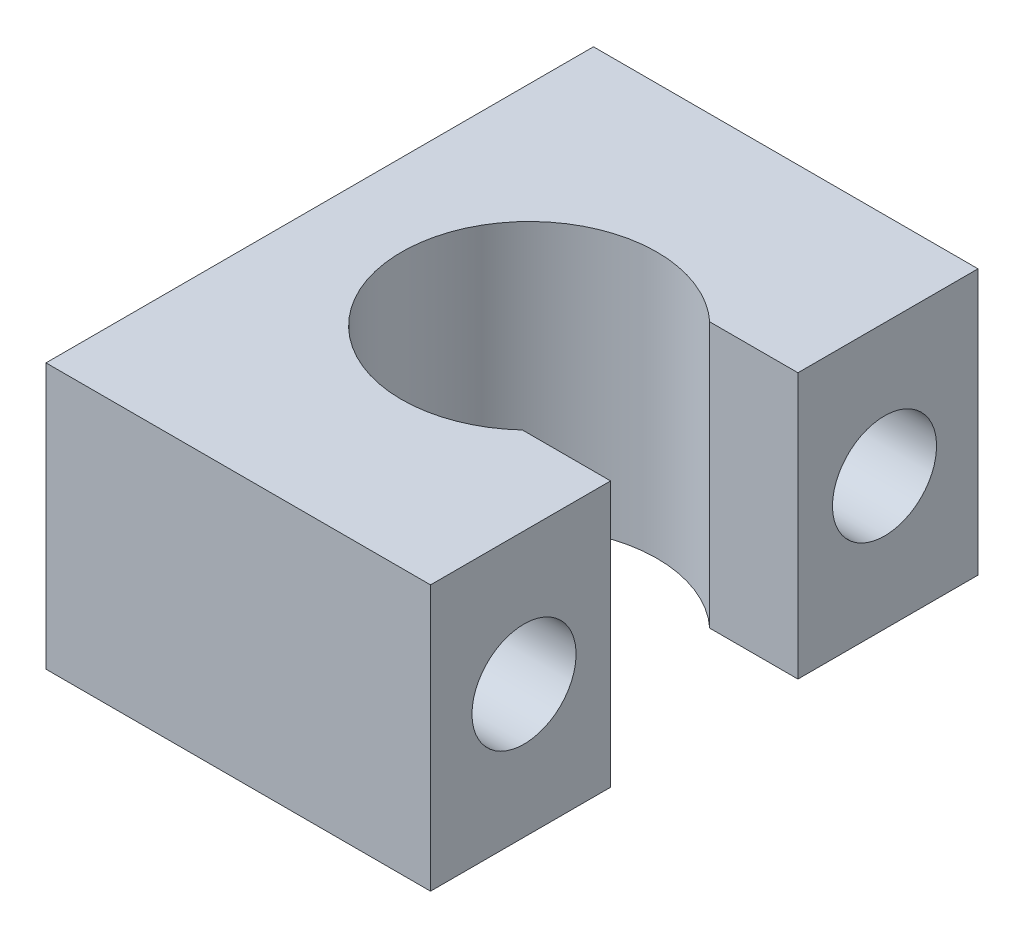
ISO-10303-21;
HEADER;
FILE_DESCRIPTION(('STEP AP214'),'2;1');
FILE_NAME('part.step','',(''),(''),'','','');
FILE_SCHEMA(('AUTOMOTIVE_DESIGN { 1 0 10303 214 1 1 1 1 }'));
ENDSEC;
DATA;
#1=APPLICATION_CONTEXT('core data for automotive mechanical design processes');
#2=APPLICATION_PROTOCOL_DEFINITION('international standard','automotive_design',2000,#1);
#3=PRODUCT_CONTEXT('',#1,'mechanical');
#4=PRODUCT('Part','Part','',(#3));
#5=PRODUCT_RELATED_PRODUCT_CATEGORY('part','',(#4));
#6=PRODUCT_DEFINITION_FORMATION('','',#4);
#7=PRODUCT_DEFINITION_CONTEXT('part definition',#1,'design');
#8=PRODUCT_DEFINITION('design','',#6,#7);
#9=PRODUCT_DEFINITION_SHAPE('','',#8);
#10=(LENGTH_UNIT() NAMED_UNIT(*) SI_UNIT(.MILLI.,.METRE.));
#11=(NAMED_UNIT(*) PLANE_ANGLE_UNIT() SI_UNIT($,.RADIAN.));
#12=(NAMED_UNIT(*) SI_UNIT($,.STERADIAN.) SOLID_ANGLE_UNIT());
#13=UNCERTAINTY_MEASURE_WITH_UNIT(LENGTH_MEASURE(1.E-05),#10,'distance_accuracy_value','');
#14=(GEOMETRIC_REPRESENTATION_CONTEXT(3) GLOBAL_UNCERTAINTY_ASSIGNED_CONTEXT((#13)) GLOBAL_UNIT_ASSIGNED_CONTEXT((#10,
#11,#12)) REPRESENTATION_CONTEXT('',''));
#15=CARTESIAN_POINT('',(0.,0.,0.));
#16=DIRECTION('',(0.,0.,1.));
#17=DIRECTION('',(1.,0.,0.));
#18=AXIS2_PLACEMENT_3D('',#15,#16,#17);
#19=CARTESIAN_POINT('',(10.16,14.02,14.465));
#20=DIRECTION('',(-1.,0.,0.));
#21=DIRECTION('',(0.,0.,1.));
#22=AXIS2_PLACEMENT_3D('',#19,#20,#21);
#23=PLANE('',#22);
#24=CARTESIAN_POINT('',(10.16,7.01,9.525));
#25=DIRECTION('',(-1.,0.,0.));
#26=DIRECTION('',(0.,0.,1.));
#27=AXIS2_PLACEMENT_3D('',#24,#25,#26);
#28=CIRCLE('',#27,2.75);
#29=CARTESIAN_POINT('',(10.16,7.01,12.275));
#30=VERTEX_POINT('',#29);
#31=EDGE_CURVE('E162',#30,#30,#28,.T.);
#32=ORIENTED_EDGE('',*,*,#31,.T.);
#33=EDGE_LOOP('',(#32));
#34=FACE_BOUND('',#33,.T.);
#35=DIRECTION('',(0.,0.,-1.));
#36=VECTOR('',#35,1.);
#37=CARTESIAN_POINT('',(10.16,0.,14.465));
#38=LINE('',#37,#36);
#39=CARTESIAN_POINT('',(10.16,0.,14.465));
#40=VERTEX_POINT('',#39);
#41=CARTESIAN_POINT('',(10.16,0.,4.95));
#42=VERTEX_POINT('',#41);
#43=EDGE_CURVE('E133',#40,#42,#38,.T.);
#44=ORIENTED_EDGE('',*,*,#43,.T.);
#45=DIRECTION('',(0.,1.,0.));
#46=VECTOR('',#45,1.);
#47=CARTESIAN_POINT('',(10.16,0.,4.95));
#48=LINE('',#47,#46);
#49=CARTESIAN_POINT('',(10.16,14.02,4.95));
#50=VERTEX_POINT('',#49);
#51=EDGE_CURVE('E166',#42,#50,#48,.T.);
#52=ORIENTED_EDGE('',*,*,#51,.T.);
#53=DIRECTION('',(0.,0.,-1.));
#54=VECTOR('',#53,1.);
#55=CARTESIAN_POINT('',(10.16,14.02,14.465));
#56=LINE('',#55,#54);
#57=CARTESIAN_POINT('',(10.16,14.02,14.465));
#58=VERTEX_POINT('',#57);
#59=EDGE_CURVE('E152',#58,#50,#56,.T.);
#60=ORIENTED_EDGE('',*,*,#59,.F.);
#61=DIRECTION('',(0.,-1.,0.));
#62=VECTOR('',#61,1.);
#63=CARTESIAN_POINT('',(10.16,14.02,14.465));
#64=LINE('',#63,#62);
#65=EDGE_CURVE('E47',#58,#40,#64,.T.);
#66=ORIENTED_EDGE('',*,*,#65,.T.);
#67=EDGE_LOOP('',(#44,#52,#60,#66));
#68=FACE_BOUND('',#67,.T.);
#69=ADVANCED_FACE('F39',(#34,#68),#23,.F.);
#70=CARTESIAN_POINT('',(-10.16,14.02,14.465));
#71=DIRECTION('',(1.,0.,0.));
#72=DIRECTION('',(0.,0.,-1.));
#73=AXIS2_PLACEMENT_3D('',#70,#71,#72);
#74=PLANE('',#73);
#75=CARTESIAN_POINT('',(-10.16,7.01,9.525));
#76=DIRECTION('',(-1.,0.,0.));
#77=DIRECTION('',(0.,0.,1.));
#78=AXIS2_PLACEMENT_3D('',#75,#76,#77);
#79=CIRCLE('',#78,2.75);
#80=CARTESIAN_POINT('',(-10.16,7.01,12.275));
#81=VERTEX_POINT('',#80);
#82=EDGE_CURVE('E286',#81,#81,#79,.T.);
#83=ORIENTED_EDGE('',*,*,#82,.F.);
#84=EDGE_LOOP('',(#83));
#85=FACE_BOUND('',#84,.T.);
#86=CARTESIAN_POINT('',(-10.16,7.01,-9.525));
#87=DIRECTION('',(-1.,0.,0.));
#88=DIRECTION('',(0.,0.,1.));
#89=AXIS2_PLACEMENT_3D('',#86,#87,#88);
#90=CIRCLE('',#89,2.75);
#91=CARTESIAN_POINT('',(-10.16,7.01,-6.775));
#92=VERTEX_POINT('',#91);
#93=EDGE_CURVE('E291',#92,#92,#90,.T.);
#94=ORIENTED_EDGE('',*,*,#93,.F.);
#95=EDGE_LOOP('',(#94));
#96=FACE_BOUND('',#95,.T.);
#97=DIRECTION('',(0.,0.,1.));
#98=VECTOR('',#97,1.);
#99=CARTESIAN_POINT('',(-10.16,0.,14.465));
#100=LINE('',#99,#98);
#101=CARTESIAN_POINT('',(-10.16,0.,-14.465));
#102=VERTEX_POINT('',#101);
#103=CARTESIAN_POINT('',(-10.16,0.,14.465));
#104=VERTEX_POINT('',#103);
#105=EDGE_CURVE('E137',#102,#104,#100,.T.);
#106=ORIENTED_EDGE('',*,*,#105,.T.);
#107=DIRECTION('',(0.,-1.,0.));
#108=VECTOR('',#107,1.);
#109=CARTESIAN_POINT('',(-10.16,14.02,14.465));
#110=LINE('',#109,#108);
#111=CARTESIAN_POINT('',(-10.16,14.02,14.465));
#112=VERTEX_POINT('',#111);
#113=EDGE_CURVE('E11',#112,#104,#110,.T.);
#114=ORIENTED_EDGE('',*,*,#113,.F.);
#115=DIRECTION('',(0.,0.,1.));
#116=VECTOR('',#115,1.);
#117=CARTESIAN_POINT('',(-10.16,14.02,14.465));
#118=LINE('',#117,#116);
#119=CARTESIAN_POINT('',(-10.16,14.02,-14.465));
#120=VERTEX_POINT('',#119);
#121=EDGE_CURVE('E142',#120,#112,#118,.T.);
#122=ORIENTED_EDGE('',*,*,#121,.F.);
#123=DIRECTION('',(0.,-1.,0.));
#124=VECTOR('',#123,1.);
#125=CARTESIAN_POINT('',(-10.16,14.02,-14.465));
#126=LINE('',#125,#124);
#127=EDGE_CURVE('E143',#120,#102,#126,.T.);
#128=ORIENTED_EDGE('',*,*,#127,.T.);
#129=EDGE_LOOP('',(#106,#114,#122,#128));
#130=FACE_BOUND('',#129,.T.);
#131=ADVANCED_FACE('F41',(#85,#96,#130),#74,.F.);
#132=CARTESIAN_POINT('',(10.16,14.02,14.465));
#133=DIRECTION('',(0.,0.,-1.));
#134=DIRECTION('',(-1.,0.,0.));
#135=AXIS2_PLACEMENT_3D('',#132,#133,#134);
#136=PLANE('',#135);
#137=DIRECTION('',(1.,0.,0.));
#138=VECTOR('',#137,1.);
#139=CARTESIAN_POINT('',(10.16,0.,14.465));
#140=LINE('',#139,#138);
#141=EDGE_CURVE('E134',#104,#40,#140,.T.);
#142=ORIENTED_EDGE('',*,*,#141,.T.);
#143=ORIENTED_EDGE('',*,*,#65,.F.);
#144=DIRECTION('',(1.,0.,0.));
#145=VECTOR('',#144,1.);
#146=CARTESIAN_POINT('',(10.16,14.02,14.465));
#147=LINE('',#146,#145);
#148=EDGE_CURVE('E91',#112,#58,#147,.T.);
#149=ORIENTED_EDGE('',*,*,#148,.F.);
#150=ORIENTED_EDGE('',*,*,#113,.T.);
#151=EDGE_LOOP('',(#142,#143,#149,#150));
#152=FACE_BOUND('',#151,.T.);
#153=ADVANCED_FACE('F187',(#152),#136,.F.);
#154=CARTESIAN_POINT('',(10.16,7.01,-9.525));
#155=DIRECTION('',(-1.,0.,0.));
#156=DIRECTION('',(0.,0.,1.));
#157=AXIS2_PLACEMENT_3D('',#154,#155,#156);
#158=CIRCLE('',#157,2.75);
#159=CARTESIAN_POINT('',(10.16,7.01,-6.775));
#160=VERTEX_POINT('',#159);
#161=EDGE_CURVE('E287',#160,#160,#158,.T.);
#162=ORIENTED_EDGE('',*,*,#161,.T.);
#163=EDGE_LOOP('',(#162));
#164=FACE_BOUND('',#163,.T.);
#165=CARTESIAN_POINT('',(10.16,14.02,-4.95));
#166=VERTEX_POINT('',#165);
#167=CARTESIAN_POINT('',(10.16,14.02,-14.465));
#168=VERTEX_POINT('',#167);
#169=EDGE_CURVE('E128',#166,#168,#56,.T.);
#170=ORIENTED_EDGE('',*,*,#169,.F.);
#171=DIRECTION('',(0.,1.,0.));
#172=VECTOR('',#171,1.);
#173=CARTESIAN_POINT('',(10.16,0.,-4.95));
#174=LINE('',#173,#172);
#175=CARTESIAN_POINT('',(10.16,0.,-4.95));
#176=VERTEX_POINT('',#175);
#177=EDGE_CURVE('E116',#176,#166,#174,.T.);
#178=ORIENTED_EDGE('',*,*,#177,.F.);
#179=CARTESIAN_POINT('',(10.16,0.,-14.465));
#180=VERTEX_POINT('',#179);
#181=EDGE_CURVE('E127',#176,#180,#38,.T.);
#182=ORIENTED_EDGE('',*,*,#181,.T.);
#183=DIRECTION('',(0.,-1.,0.));
#184=VECTOR('',#183,1.);
#185=CARTESIAN_POINT('',(10.16,14.02,-14.465));
#186=LINE('',#185,#184);
#187=EDGE_CURVE('E145',#168,#180,#186,.T.);
#188=ORIENTED_EDGE('',*,*,#187,.F.);
#189=EDGE_LOOP('',(#170,#178,#182,#188));
#190=FACE_BOUND('',#189,.T.);
#191=ADVANCED_FACE('F125',(#164,#190),#23,.F.);
#192=CARTESIAN_POINT('',(10.16,14.02,-14.465));
#193=DIRECTION('',(0.,0.,1.));
#194=DIRECTION('',(1.,0.,0.));
#195=AXIS2_PLACEMENT_3D('',#192,#193,#194);
#196=PLANE('',#195);
#197=DIRECTION('',(-1.,0.,0.));
#198=VECTOR('',#197,1.);
#199=CARTESIAN_POINT('',(10.16,0.,-14.465));
#200=LINE('',#199,#198);
#201=EDGE_CURVE('E84',#180,#102,#200,.T.);
#202=ORIENTED_EDGE('',*,*,#201,.T.);
#203=ORIENTED_EDGE('',*,*,#127,.F.);
#204=DIRECTION('',(-1.,0.,0.));
#205=VECTOR('',#204,1.);
#206=CARTESIAN_POINT('',(10.16,14.02,-14.465));
#207=LINE('',#206,#205);
#208=EDGE_CURVE('E63',#168,#120,#207,.T.);
#209=ORIENTED_EDGE('',*,*,#208,.F.);
#210=ORIENTED_EDGE('',*,*,#187,.T.);
#211=EDGE_LOOP('',(#202,#203,#209,#210));
#212=FACE_BOUND('',#211,.T.);
#213=ADVANCED_FACE('F178',(#212),#196,.F.);
#214=CARTESIAN_POINT('',(0.,14.02,0.));
#215=DIRECTION('',(0.,1.,0.));
#216=DIRECTION('',(0.,0.,1.));
#217=AXIS2_PLACEMENT_3D('',#214,#215,#216);
#218=PLANE('',#217);
#219=DIRECTION('',(1.,0.,0.));
#220=VECTOR('',#219,1.);
#221=CARTESIAN_POINT('',(10.16,14.02,4.95));
#222=LINE('',#221,#220);
#223=CARTESIAN_POINT('',(5.49911756223348,14.02,4.95));
#224=VERTEX_POINT('',#223);
#225=EDGE_CURVE('E121',#224,#50,#222,.T.);
#226=ORIENTED_EDGE('',*,*,#225,.F.);
#227=CARTESIAN_POINT('',(0.909999999999975,14.02,0.));
#228=DIRECTION('',(0.,1.,0.));
#229=DIRECTION('',(0.,0.,1.));
#230=AXIS2_PLACEMENT_3D('',#227,#228,#229);
#231=CIRCLE('',#230,6.75);
#232=CARTESIAN_POINT('',(5.49911756223348,14.02,-4.95));
#233=VERTEX_POINT('',#232);
#234=EDGE_CURVE('E161',#233,#224,#231,.T.);
#235=ORIENTED_EDGE('',*,*,#234,.F.);
#236=DIRECTION('',(-1.,0.,0.));
#237=VECTOR('',#236,1.);
#238=CARTESIAN_POINT('',(10.16,14.02,-4.95));
#239=LINE('',#238,#237);
#240=EDGE_CURVE('E159',#166,#233,#239,.T.);
#241=ORIENTED_EDGE('',*,*,#240,.F.);
#242=ORIENTED_EDGE('',*,*,#169,.T.);
#243=ORIENTED_EDGE('',*,*,#208,.T.);
#244=ORIENTED_EDGE('',*,*,#121,.T.);
#245=ORIENTED_EDGE('',*,*,#148,.T.);
#246=ORIENTED_EDGE('',*,*,#59,.T.);
#247=EDGE_LOOP('',(#226,#235,#241,#242,#243,#244,#245,#246));
#248=FACE_BOUND('',#247,.T.);
#249=ADVANCED_FACE('F180',(#248),#218,.T.);
#250=CARTESIAN_POINT('',(0.,0.,0.));
#251=DIRECTION('',(0.,1.,0.));
#252=DIRECTION('',(0.,0.,1.));
#253=AXIS2_PLACEMENT_3D('',#250,#251,#252);
#254=PLANE('',#253);
#255=CARTESIAN_POINT('',(0.909999999999975,0.,0.));
#256=DIRECTION('',(0.,1.,0.));
#257=DIRECTION('',(0.,0.,1.));
#258=AXIS2_PLACEMENT_3D('',#255,#256,#257);
#259=CIRCLE('',#258,6.75);
#260=CARTESIAN_POINT('',(5.49911756223348,0.,-4.95));
#261=VERTEX_POINT('',#260);
#262=CARTESIAN_POINT('',(5.49911756223348,0.,4.95));
#263=VERTEX_POINT('',#262);
#264=EDGE_CURVE('E54',#261,#263,#259,.T.);
#265=ORIENTED_EDGE('',*,*,#264,.T.);
#266=DIRECTION('',(1.,0.,0.));
#267=VECTOR('',#266,1.);
#268=CARTESIAN_POINT('',(10.16,0.,4.95));
#269=LINE('',#268,#267);
#270=EDGE_CURVE('E129',#263,#42,#269,.T.);
#271=ORIENTED_EDGE('',*,*,#270,.T.);
#272=ORIENTED_EDGE('',*,*,#43,.F.);
#273=ORIENTED_EDGE('',*,*,#141,.F.);
#274=ORIENTED_EDGE('',*,*,#105,.F.);
#275=ORIENTED_EDGE('',*,*,#201,.F.);
#276=ORIENTED_EDGE('',*,*,#181,.F.);
#277=DIRECTION('',(-1.,0.,0.));
#278=VECTOR('',#277,1.);
#279=CARTESIAN_POINT('',(10.16,0.,-4.95));
#280=LINE('',#279,#278);
#281=EDGE_CURVE('E112',#176,#261,#280,.T.);
#282=ORIENTED_EDGE('',*,*,#281,.T.);
#283=EDGE_LOOP('',(#265,#271,#272,#273,#274,#275,#276,#282));
#284=FACE_BOUND('',#283,.T.);
#285=ADVANCED_FACE('F131',(#284),#254,.F.);
#286=CARTESIAN_POINT('',(10.16,0.,4.95));
#287=DIRECTION('',(0.,0.,1.));
#288=DIRECTION('',(1.,0.,0.));
#289=AXIS2_PLACEMENT_3D('',#286,#287,#288);
#290=PLANE('',#289);
#291=ORIENTED_EDGE('',*,*,#225,.T.);
#292=ORIENTED_EDGE('',*,*,#51,.F.);
#293=ORIENTED_EDGE('',*,*,#270,.F.);
#294=DIRECTION('',(0.,1.,0.));
#295=VECTOR('',#294,1.);
#296=CARTESIAN_POINT('',(5.49911756223348,0.,4.95));
#297=LINE('',#296,#295);
#298=EDGE_CURVE('E168',#263,#224,#297,.T.);
#299=ORIENTED_EDGE('',*,*,#298,.T.);
#300=EDGE_LOOP('',(#291,#292,#293,#299));
#301=FACE_BOUND('',#300,.T.);
#302=ADVANCED_FACE('F239',(#301),#290,.F.);
#303=CARTESIAN_POINT('',(0.909999999999975,0.,0.));
#304=DIRECTION('',(0.,1.,0.));
#305=DIRECTION('',(0.,0.,1.));
#306=AXIS2_PLACEMENT_3D('',#303,#304,#305);
#307=CYLINDRICAL_SURFACE('',#306,6.75);
#308=ORIENTED_EDGE('',*,*,#234,.T.);
#309=ORIENTED_EDGE('',*,*,#298,.F.);
#310=ORIENTED_EDGE('',*,*,#264,.F.);
#311=DIRECTION('',(0.,1.,0.));
#312=VECTOR('',#311,1.);
#313=CARTESIAN_POINT('',(5.49911756223348,0.,-4.95));
#314=LINE('',#313,#312);
#315=EDGE_CURVE('E118',#261,#233,#314,.T.);
#316=ORIENTED_EDGE('',*,*,#315,.T.);
#317=EDGE_LOOP('',(#308,#309,#310,#316));
#318=FACE_BOUND('',#317,.T.);
#319=ADVANCED_FACE('F242',(#318),#307,.F.);
#320=CARTESIAN_POINT('',(10.16,0.,-4.95));
#321=DIRECTION('',(0.,0.,-1.));
#322=DIRECTION('',(-1.,0.,0.));
#323=AXIS2_PLACEMENT_3D('',#320,#321,#322);
#324=PLANE('',#323);
#325=ORIENTED_EDGE('',*,*,#240,.T.);
#326=ORIENTED_EDGE('',*,*,#315,.F.);
#327=ORIENTED_EDGE('',*,*,#281,.F.);
#328=ORIENTED_EDGE('',*,*,#177,.T.);
#329=EDGE_LOOP('',(#325,#326,#327,#328));
#330=FACE_BOUND('',#329,.T.);
#331=ADVANCED_FACE('F115',(#330),#324,.F.);
#332=CARTESIAN_POINT('',(10.16,7.01,-9.525));
#333=DIRECTION('',(-1.,0.,0.));
#334=DIRECTION('',(0.,0.,1.));
#335=AXIS2_PLACEMENT_3D('',#332,#333,#334);
#336=CYLINDRICAL_SURFACE('',#335,2.75);
#337=ORIENTED_EDGE('',*,*,#161,.F.);
#338=EDGE_LOOP('',(#337));
#339=FACE_BOUND('',#338,.T.);
#340=ORIENTED_EDGE('',*,*,#93,.T.);
#341=EDGE_LOOP('',(#340));
#342=FACE_BOUND('',#341,.T.);
#343=ADVANCED_FACE('F215',(#339,#342),#336,.F.);
#344=CARTESIAN_POINT('',(10.16,7.01,9.525));
#345=DIRECTION('',(-1.,0.,0.));
#346=DIRECTION('',(0.,0.,1.));
#347=AXIS2_PLACEMENT_3D('',#344,#345,#346);
#348=CYLINDRICAL_SURFACE('',#347,2.75);
#349=ORIENTED_EDGE('',*,*,#31,.F.);
#350=EDGE_LOOP('',(#349));
#351=FACE_BOUND('',#350,.T.);
#352=ORIENTED_EDGE('',*,*,#82,.T.);
#353=EDGE_LOOP('',(#352));
#354=FACE_BOUND('',#353,.T.);
#355=ADVANCED_FACE('F220',(#351,#354),#348,.F.);
#356=CLOSED_SHELL('',(#69,#131,#153,#191,#213,#249,#285,#302,#319,#331,#343,#355));
#357=MANIFOLD_SOLID_BREP('B2',#356);
#358=ADVANCED_BREP_SHAPE_REPRESENTATION('',(#18,#357),#14);
#359=SHAPE_DEFINITION_REPRESENTATION(#9,#358);
ENDSEC;
END-ISO-10303-21;
